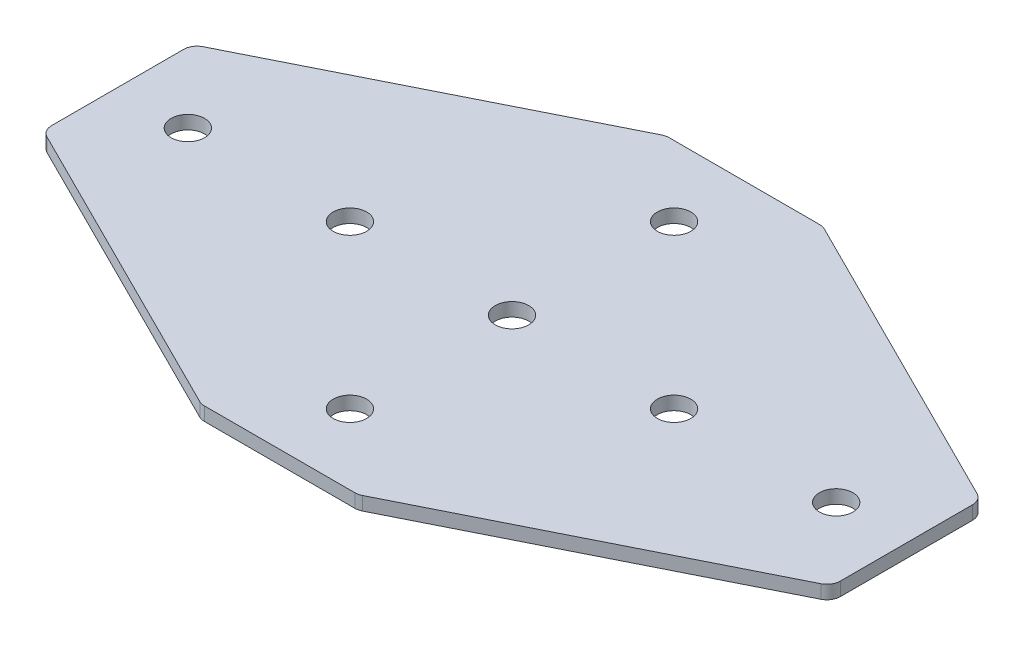
ISO-10303-21;
HEADER;
FILE_DESCRIPTION(('STEP AP214'),'2;1');
FILE_NAME('part.step','',(''),(''),'','','');
FILE_SCHEMA(('AUTOMOTIVE_DESIGN { 1 0 10303 214 1 1 1 1 }'));
ENDSEC;
DATA;
#1=APPLICATION_CONTEXT('core data for automotive mechanical design processes');
#2=APPLICATION_PROTOCOL_DEFINITION('international standard','automotive_design',2000,#1);
#3=PRODUCT_CONTEXT('',#1,'mechanical');
#4=PRODUCT('Part','Part','',(#3));
#5=PRODUCT_RELATED_PRODUCT_CATEGORY('part','',(#4));
#6=PRODUCT_DEFINITION_FORMATION('','',#4);
#7=PRODUCT_DEFINITION_CONTEXT('part definition',#1,'design');
#8=PRODUCT_DEFINITION('design','',#6,#7);
#9=PRODUCT_DEFINITION_SHAPE('','',#8);
#10=(LENGTH_UNIT() NAMED_UNIT(*) SI_UNIT(.MILLI.,.METRE.));
#11=(NAMED_UNIT(*) PLANE_ANGLE_UNIT() SI_UNIT($,.RADIAN.));
#12=(NAMED_UNIT(*) SI_UNIT($,.STERADIAN.) SOLID_ANGLE_UNIT());
#13=UNCERTAINTY_MEASURE_WITH_UNIT(LENGTH_MEASURE(1.E-05),#10,'distance_accuracy_value','');
#14=(GEOMETRIC_REPRESENTATION_CONTEXT(3) GLOBAL_UNCERTAINTY_ASSIGNED_CONTEXT((#13)) GLOBAL_UNIT_ASSIGNED_CONTEXT((#10,
#11,#12)) REPRESENTATION_CONTEXT('',''));
#15=CARTESIAN_POINT('',(0.,0.,0.));
#16=DIRECTION('',(0.,0.,1.));
#17=DIRECTION('',(1.,0.,0.));
#18=AXIS2_PLACEMENT_3D('',#15,#16,#17);
#19=CARTESIAN_POINT('',(-1.7997230439164,1.02470932674123,-0.474616608812539));
#20=DIRECTION('',(0.,-1.,0.));
#21=DIRECTION('',(0.,0.,-1.));
#22=AXIS2_PLACEMENT_3D('',#19,#20,#21);
#23=PLANE('',#22);
#24=CARTESIAN_POINT('',(-31.7997230439164,1.02470932674123,-0.474616608812521));
#25=DIRECTION('',(0.,-1.,0.));
#26=DIRECTION('',(0.,0.,1.));
#27=AXIS2_PLACEMENT_3D('',#24,#25,#26);
#28=CIRCLE('',#27,3.1);
#29=CARTESIAN_POINT('',(-31.7997230439164,1.02470932674123,2.62538339118748));
#30=VERTEX_POINT('',#29);
#31=EDGE_CURVE('E194',#30,#30,#28,.T.);
#32=ORIENTED_EDGE('',*,*,#31,.F.);
#33=EDGE_LOOP('',(#32));
#34=FACE_BOUND('',#33,.T.);
#35=CARTESIAN_POINT('',(-61.7997230439164,1.02470932674123,-0.474616608812524));
#36=DIRECTION('',(0.,-1.,0.));
#37=DIRECTION('',(0.,0.,1.));
#38=AXIS2_PLACEMENT_3D('',#35,#36,#37);
#39=CIRCLE('',#38,3.1);
#40=CARTESIAN_POINT('',(-61.7997230439164,1.02470932674123,2.62538339118748));
#41=VERTEX_POINT('',#40);
#42=EDGE_CURVE('E188',#41,#41,#39,.T.);
#43=ORIENTED_EDGE('',*,*,#42,.F.);
#44=EDGE_LOOP('',(#43));
#45=FACE_BOUND('',#44,.T.);
#46=CARTESIAN_POINT('',(-1.7997230439164,1.02470932674123,-0.474616608812539));
#47=DIRECTION('',(0.,1.,0.));
#48=DIRECTION('',(0.,0.,1.));
#49=AXIS2_PLACEMENT_3D('',#46,#47,#48);
#50=CIRCLE('',#49,3.1);
#51=CARTESIAN_POINT('',(-1.7997230439164,1.02470932674123,2.62538339118746));
#52=VERTEX_POINT('',#51);
#53=EDGE_CURVE('E248',#52,#52,#50,.T.);
#54=ORIENTED_EDGE('',*,*,#53,.T.);
#55=EDGE_LOOP('',(#54));
#56=FACE_BOUND('',#55,.T.);
#57=CARTESIAN_POINT('',(68.7002769560835,1.02470932674123,-12.693463659438));
#58=DIRECTION('',(0.,1.,0.));
#59=DIRECTION('',(0.,0.,1.));
#60=AXIS2_PLACEMENT_3D('',#57,#58,#59);
#61=CIRCLE('',#60,2.5);
#62=CARTESIAN_POINT('',(71.2002769560835,1.02470932674123,-12.693463659438));
#63=VERTEX_POINT('',#62);
#64=CARTESIAN_POINT('',(69.8183109448334,1.02470932674123,-14.9295316369378));
#65=VERTEX_POINT('',#64);
#66=EDGE_CURVE('E174',#63,#65,#61,.T.);
#67=ORIENTED_EDGE('',*,*,#66,.F.);
#68=DIRECTION('',(0.,0.,-1.));
#69=VECTOR('',#68,1.);
#70=CARTESIAN_POINT('',(71.2002769560835,1.02470932674123,13.2893154136877));
#71=LINE('',#70,#69);
#72=CARTESIAN_POINT('',(71.2002769560835,1.02470932674123,11.744230441813));
#73=VERTEX_POINT('',#72);
#74=EDGE_CURVE('E259',#73,#63,#71,.T.);
#75=ORIENTED_EDGE('',*,*,#74,.F.);
#76=CARTESIAN_POINT('',(68.7002769560835,1.02470932674123,11.744230441813));
#77=DIRECTION('',(0.,-1.,0.));
#78=DIRECTION('',(0.,0.,-1.));
#79=AXIS2_PLACEMENT_3D('',#76,#77,#78);
#80=CIRCLE('',#79,2.5);
#81=CARTESIAN_POINT('',(69.8183109448334,1.02470932674123,13.9802984193128));
#82=VERTEX_POINT('',#81);
#83=EDGE_CURVE('E31',#73,#82,#80,.T.);
#84=ORIENTED_EDGE('',*,*,#83,.T.);
#85=DIRECTION('',(0.894427190999916,0.,-0.447213595499958));
#86=VECTOR('',#85,1.);
#87=CARTESIAN_POINT('',(12.7281410010841,1.02470932674123,42.5253833911874));
#88=LINE('',#87,#86);
#89=CARTESIAN_POINT('',(13.2560050460846,1.02470932674123,42.2614513686872));
#90=VERTEX_POINT('',#89);
#91=EDGE_CURVE('E256',#90,#82,#88,.T.);
#92=ORIENTED_EDGE('',*,*,#91,.F.);
#93=CARTESIAN_POINT('',(12.1379710573347,1.02470932674123,40.0253833911874));
#94=DIRECTION('',(0.,-1.,0.));
#95=DIRECTION('',(0.,0.,-1.));
#96=AXIS2_PLACEMENT_3D('',#93,#94,#95);
#97=CIRCLE('',#96,2.5);
#98=CARTESIAN_POINT('',(12.1379710573347,1.02470932674123,42.5253833911874));
#99=VERTEX_POINT('',#98);
#100=EDGE_CURVE('E274',#90,#99,#97,.T.);
#101=ORIENTED_EDGE('',*,*,#100,.T.);
#102=DIRECTION('',(1.,0.,0.));
#103=VECTOR('',#102,1.);
#104=CARTESIAN_POINT('',(-14.7997230439165,1.02470932674123,42.5253833911874));
#105=LINE('',#104,#103);
#106=CARTESIAN_POINT('',(-15.7374171451674,1.02470932674123,42.5253833911874));
#107=VERTEX_POINT('',#106);
#108=EDGE_CURVE('E254',#107,#99,#105,.T.);
#109=ORIENTED_EDGE('',*,*,#108,.F.);
#110=CARTESIAN_POINT('',(-15.7374171451674,1.02470932674123,40.0253833911874));
#111=DIRECTION('',(0.,1.,0.));
#112=DIRECTION('',(0.,0.,-1.));
#113=AXIS2_PLACEMENT_3D('',#110,#111,#112);
#114=CIRCLE('',#113,2.5);
#115=CARTESIAN_POINT('',(-16.8554511339173,1.02470932674123,42.2614513686872));
#116=VERTEX_POINT('',#115);
#117=EDGE_CURVE('E219',#116,#107,#114,.T.);
#118=ORIENTED_EDGE('',*,*,#117,.F.);
#119=DIRECTION('',(-0.894427190999916,0.,-0.447213595499958));
#120=VECTOR('',#119,1.);
#121=CARTESIAN_POINT('',(-16.3275870889169,1.02470932674123,42.5253833911874));
#122=LINE('',#121,#120);
#123=CARTESIAN_POINT('',(-73.4177570326662,1.02470932674123,13.9802984193128));
#124=VERTEX_POINT('',#123);
#125=EDGE_CURVE('E200',#116,#124,#122,.T.);
#126=ORIENTED_EDGE('',*,*,#125,.T.);
#127=CARTESIAN_POINT('',(-72.2997230439163,1.02470932674123,11.744230441813));
#128=DIRECTION('',(0.,1.,0.));
#129=DIRECTION('',(0.,0.,-1.));
#130=AXIS2_PLACEMENT_3D('',#127,#128,#129);
#131=CIRCLE('',#130,2.5);
#132=CARTESIAN_POINT('',(-74.7997230439163,1.02470932674123,11.744230441813));
#133=VERTEX_POINT('',#132);
#134=EDGE_CURVE('E216',#133,#124,#131,.T.);
#135=ORIENTED_EDGE('',*,*,#134,.F.);
#136=DIRECTION('',(0.,0.,-1.));
#137=VECTOR('',#136,1.);
#138=CARTESIAN_POINT('',(-74.7997230439163,1.02470932674123,13.2893154136877));
#139=LINE('',#138,#137);
#140=CARTESIAN_POINT('',(-74.7997230439163,1.02470932674123,-12.6934636594381));
#141=VERTEX_POINT('',#140);
#142=EDGE_CURVE('E203',#133,#141,#139,.T.);
#143=ORIENTED_EDGE('',*,*,#142,.T.);
#144=CARTESIAN_POINT('',(-72.2997230439163,1.02470932674123,-12.6934636594381));
#145=DIRECTION('',(0.,-1.,0.));
#146=DIRECTION('',(0.,0.,1.));
#147=AXIS2_PLACEMENT_3D('',#144,#145,#146);
#148=CIRCLE('',#147,2.5);
#149=CARTESIAN_POINT('',(-73.4177570326662,1.02470932674123,-14.9295316369379));
#150=VERTEX_POINT('',#149);
#151=EDGE_CURVE('E140',#141,#150,#148,.T.);
#152=ORIENTED_EDGE('',*,*,#151,.T.);
#153=DIRECTION('',(-0.894427190999916,0.,0.447213595499958));
#154=VECTOR('',#153,1.);
#155=CARTESIAN_POINT('',(-16.3275870889169,1.02470932674123,-43.4746166088125));
#156=LINE('',#155,#154);
#157=CARTESIAN_POINT('',(-16.8554511339173,1.02470932674123,-43.2106845863123));
#158=VERTEX_POINT('',#157);
#159=EDGE_CURVE('E414',#158,#150,#156,.T.);
#160=ORIENTED_EDGE('',*,*,#159,.F.);
#161=CARTESIAN_POINT('',(-15.7374171451674,1.02470932674123,-40.9746166088125));
#162=DIRECTION('',(0.,-1.,0.));
#163=DIRECTION('',(0.,0.,1.));
#164=AXIS2_PLACEMENT_3D('',#161,#162,#163);
#165=CIRCLE('',#164,2.5);
#166=CARTESIAN_POINT('',(-15.7374171451674,1.02470932674123,-43.4746166088125));
#167=VERTEX_POINT('',#166);
#168=EDGE_CURVE('E399',#158,#167,#165,.T.);
#169=ORIENTED_EDGE('',*,*,#168,.T.);
#170=DIRECTION('',(1.,0.,0.));
#171=VECTOR('',#170,1.);
#172=CARTESIAN_POINT('',(-14.7997230439165,1.02470932674123,-43.4746166088125));
#173=LINE('',#172,#171);
#174=CARTESIAN_POINT('',(12.1379710573347,1.02470932674123,-43.4746166088125));
#175=VERTEX_POINT('',#174);
#176=EDGE_CURVE('E136',#167,#175,#173,.T.);
#177=ORIENTED_EDGE('',*,*,#176,.T.);
#178=CARTESIAN_POINT('',(12.1379710573347,1.02470932674123,-40.9746166088125));
#179=DIRECTION('',(0.,1.,0.));
#180=DIRECTION('',(0.,0.,1.));
#181=AXIS2_PLACEMENT_3D('',#178,#179,#180);
#182=CIRCLE('',#181,2.5);
#183=CARTESIAN_POINT('',(13.2560050460846,1.02470932674123,-43.2106845863123));
#184=VERTEX_POINT('',#183);
#185=EDGE_CURVE('E177',#184,#175,#182,.T.);
#186=ORIENTED_EDGE('',*,*,#185,.F.);
#187=DIRECTION('',(0.894427190999916,0.,0.447213595499958));
#188=VECTOR('',#187,1.);
#189=CARTESIAN_POINT('',(12.7281410010841,1.02470932674123,-43.4746166088125));
#190=LINE('',#189,#188);
#191=EDGE_CURVE('E165',#184,#65,#190,.T.);
#192=ORIENTED_EDGE('',*,*,#191,.T.);
#193=EDGE_LOOP('',(#67,#75,#84,#92,#101,#109,#118,#126,#135,#143,#152,#160,#169,#177,#186,#192));
#194=FACE_BOUND('',#193,.T.);
#195=CARTESIAN_POINT('',(58.2002769560836,1.02470932674123,-0.474616608812539));
#196=DIRECTION('',(0.,1.,0.));
#197=DIRECTION('',(0.,0.,1.));
#198=AXIS2_PLACEMENT_3D('',#195,#196,#197);
#199=CIRCLE('',#198,3.1);
#200=CARTESIAN_POINT('',(58.2002769560836,1.02470932674123,2.62538339118746));
#201=VERTEX_POINT('',#200);
#202=EDGE_CURVE('E230',#201,#201,#199,.T.);
#203=ORIENTED_EDGE('',*,*,#202,.T.);
#204=EDGE_LOOP('',(#203));
#205=FACE_BOUND('',#204,.T.);
#206=CARTESIAN_POINT('',(-1.79972304391641,1.02470932674123,29.5253833911875));
#207=DIRECTION('',(0.,1.,0.));
#208=DIRECTION('',(0.,0.,1.));
#209=AXIS2_PLACEMENT_3D('',#206,#207,#208);
#210=CIRCLE('',#209,3.1);
#211=CARTESIAN_POINT('',(-1.79972304391641,1.02470932674123,32.6253833911875));
#212=VERTEX_POINT('',#211);
#213=EDGE_CURVE('E236',#212,#212,#210,.T.);
#214=ORIENTED_EDGE('',*,*,#213,.T.);
#215=EDGE_LOOP('',(#214));
#216=FACE_BOUND('',#215,.T.);
#217=CARTESIAN_POINT('',(28.2002769560836,1.02470932674123,-0.474616608812529));
#218=DIRECTION('',(0.,1.,0.));
#219=DIRECTION('',(0.,0.,1.));
#220=AXIS2_PLACEMENT_3D('',#217,#218,#219);
#221=CIRCLE('',#220,3.1);
#222=CARTESIAN_POINT('',(28.2002769560836,1.02470932674123,2.62538339118747));
#223=VERTEX_POINT('',#222);
#224=EDGE_CURVE('E242',#223,#223,#221,.T.);
#225=ORIENTED_EDGE('',*,*,#224,.T.);
#226=EDGE_LOOP('',(#225));
#227=FACE_BOUND('',#226,.T.);
#228=CARTESIAN_POINT('',(-1.79972304391641,1.02470932674123,-30.4746166088125));
#229=DIRECTION('',(0.,-1.,0.));
#230=DIRECTION('',(0.,0.,-1.));
#231=AXIS2_PLACEMENT_3D('',#228,#229,#230);
#232=CIRCLE('',#231,3.1);
#233=CARTESIAN_POINT('',(-1.79972304391641,1.02470932674123,-33.5746166088125));
#234=VERTEX_POINT('',#233);
#235=EDGE_CURVE('E157',#234,#234,#232,.T.);
#236=ORIENTED_EDGE('',*,*,#235,.F.);
#237=EDGE_LOOP('',(#236));
#238=FACE_BOUND('',#237,.T.);
#239=ADVANCED_FACE('F16',(#34,#45,#56,#194,#205,#216,#227,#238),#23,.T.);
#240=CARTESIAN_POINT('',(71.2002769560835,1.02470932674123,13.2893154136877));
#241=DIRECTION('',(1.,0.,0.));
#242=DIRECTION('',(0.,0.,-1.));
#243=AXIS2_PLACEMENT_3D('',#240,#241,#242);
#244=PLANE('',#243);
#245=ORIENTED_EDGE('',*,*,#74,.T.);
#246=DIRECTION('',(0.,1.,0.));
#247=VECTOR('',#246,1.);
#248=CARTESIAN_POINT('',(71.2002769560835,1.02470932674123,-12.693463659438));
#249=LINE('',#248,#247);
#250=CARTESIAN_POINT('',(71.2002769560835,3.52470932674123,-12.693463659438));
#251=VERTEX_POINT('',#250);
#252=EDGE_CURVE('E184',#251,#63,#249,.F.);
#253=ORIENTED_EDGE('',*,*,#252,.F.);
#254=DIRECTION('',(0.,0.,-1.));
#255=VECTOR('',#254,1.);
#256=CARTESIAN_POINT('',(71.2002769560835,3.52470932674123,13.2893154136877));
#257=LINE('',#256,#255);
#258=CARTESIAN_POINT('',(71.2002769560835,3.52470932674123,11.744230441813));
#259=VERTEX_POINT('',#258);
#260=EDGE_CURVE('E257',#259,#251,#257,.T.);
#261=ORIENTED_EDGE('',*,*,#260,.F.);
#262=DIRECTION('',(0.,1.,0.));
#263=VECTOR('',#262,1.);
#264=CARTESIAN_POINT('',(71.2002769560835,1.02470932674123,11.744230441813));
#265=LINE('',#264,#263);
#266=EDGE_CURVE('E10',#259,#73,#265,.F.);
#267=ORIENTED_EDGE('',*,*,#266,.T.);
#268=EDGE_LOOP('',(#245,#253,#261,#267));
#269=FACE_BOUND('',#268,.T.);
#270=ADVANCED_FACE('F297',(#269),#244,.T.);
#271=CARTESIAN_POINT('',(-1.7997230439164,3.52470932674123,-0.474616608812539));
#272=DIRECTION('',(0.,-1.,0.));
#273=DIRECTION('',(0.,0.,-1.));
#274=AXIS2_PLACEMENT_3D('',#271,#272,#273);
#275=PLANE('',#274);
#276=CARTESIAN_POINT('',(-31.7997230439164,3.52470932674123,-0.474616608812521));
#277=DIRECTION('',(0.,-1.,0.));
#278=DIRECTION('',(0.,0.,1.));
#279=AXIS2_PLACEMENT_3D('',#276,#277,#278);
#280=CIRCLE('',#279,3.1);
#281=CARTESIAN_POINT('',(-31.7997230439164,3.52470932674123,2.62538339118748));
#282=VERTEX_POINT('',#281);
#283=EDGE_CURVE('E191',#282,#282,#280,.T.);
#284=ORIENTED_EDGE('',*,*,#283,.T.);
#285=EDGE_LOOP('',(#284));
#286=FACE_BOUND('',#285,.T.);
#287=CARTESIAN_POINT('',(-61.7997230439164,3.52470932674123,-0.474616608812524));
#288=DIRECTION('',(0.,-1.,0.));
#289=DIRECTION('',(0.,0.,1.));
#290=AXIS2_PLACEMENT_3D('',#287,#288,#289);
#291=CIRCLE('',#290,3.1);
#292=CARTESIAN_POINT('',(-61.7997230439164,3.52470932674123,2.62538339118748));
#293=VERTEX_POINT('',#292);
#294=EDGE_CURVE('E187',#293,#293,#291,.T.);
#295=ORIENTED_EDGE('',*,*,#294,.T.);
#296=EDGE_LOOP('',(#295));
#297=FACE_BOUND('',#296,.T.);
#298=CARTESIAN_POINT('',(-1.7997230439164,3.52470932674123,-0.474616608812539));
#299=DIRECTION('',(0.,1.,0.));
#300=DIRECTION('',(0.,0.,1.));
#301=AXIS2_PLACEMENT_3D('',#298,#299,#300);
#302=CIRCLE('',#301,3.1);
#303=CARTESIAN_POINT('',(-1.7997230439164,3.52470932674123,2.62538339118746));
#304=VERTEX_POINT('',#303);
#305=EDGE_CURVE('E245',#304,#304,#302,.T.);
#306=ORIENTED_EDGE('',*,*,#305,.F.);
#307=EDGE_LOOP('',(#306));
#308=FACE_BOUND('',#307,.T.);
#309=ORIENTED_EDGE('',*,*,#260,.T.);
#310=CARTESIAN_POINT('',(68.7002769560835,3.52470932674123,-12.693463659438));
#311=DIRECTION('',(0.,1.,0.));
#312=DIRECTION('',(0.,0.,1.));
#313=AXIS2_PLACEMENT_3D('',#310,#311,#312);
#314=CIRCLE('',#313,2.5);
#315=CARTESIAN_POINT('',(69.8183109448334,3.52470932674123,-14.9295316369378));
#316=VERTEX_POINT('',#315);
#317=EDGE_CURVE('E168',#316,#251,#314,.F.);
#318=ORIENTED_EDGE('',*,*,#317,.F.);
#319=DIRECTION('',(0.894427190999916,0.,0.447213595499958));
#320=VECTOR('',#319,1.);
#321=CARTESIAN_POINT('',(12.7281410010841,3.52470932674123,-43.4746166088125));
#322=LINE('',#321,#320);
#323=CARTESIAN_POINT('',(13.2560050460846,3.52470932674123,-43.2106845863123));
#324=VERTEX_POINT('',#323);
#325=EDGE_CURVE('E156',#324,#316,#322,.T.);
#326=ORIENTED_EDGE('',*,*,#325,.F.);
#327=CARTESIAN_POINT('',(12.1379710573347,3.52470932674123,-40.9746166088125));
#328=DIRECTION('',(0.,1.,0.));
#329=DIRECTION('',(0.,0.,1.));
#330=AXIS2_PLACEMENT_3D('',#327,#328,#329);
#331=CIRCLE('',#330,2.5);
#332=CARTESIAN_POINT('',(12.1379710573347,3.52470932674123,-43.4746166088125));
#333=VERTEX_POINT('',#332);
#334=EDGE_CURVE('E155',#333,#324,#331,.F.);
#335=ORIENTED_EDGE('',*,*,#334,.F.);
#336=DIRECTION('',(1.,0.,0.));
#337=VECTOR('',#336,1.);
#338=CARTESIAN_POINT('',(-14.7997230439165,3.52470932674123,-43.4746166088125));
#339=LINE('',#338,#337);
#340=CARTESIAN_POINT('',(-15.7374171451674,3.52470932674123,-43.4746166088125));
#341=VERTEX_POINT('',#340);
#342=EDGE_CURVE('E133',#341,#333,#339,.T.);
#343=ORIENTED_EDGE('',*,*,#342,.F.);
#344=CARTESIAN_POINT('',(-15.7374171451674,3.52470932674123,-40.9746166088125));
#345=DIRECTION('',(0.,-1.,0.));
#346=DIRECTION('',(0.,0.,1.));
#347=AXIS2_PLACEMENT_3D('',#344,#345,#346);
#348=CIRCLE('',#347,2.5);
#349=CARTESIAN_POINT('',(-16.8554511339173,3.52470932674123,-43.2106845863123));
#350=VERTEX_POINT('',#349);
#351=EDGE_CURVE('E141',#341,#350,#348,.F.);
#352=ORIENTED_EDGE('',*,*,#351,.T.);
#353=DIRECTION('',(-0.894427190999916,0.,0.447213595499958));
#354=VECTOR('',#353,1.);
#355=CARTESIAN_POINT('',(-16.3275870889169,3.52470932674123,-43.4746166088125));
#356=LINE('',#355,#354);
#357=CARTESIAN_POINT('',(-73.4177570326662,3.52470932674123,-14.9295316369379));
#358=VERTEX_POINT('',#357);
#359=EDGE_CURVE('E415',#350,#358,#356,.T.);
#360=ORIENTED_EDGE('',*,*,#359,.T.);
#361=CARTESIAN_POINT('',(-72.2997230439163,3.52470932674123,-12.6934636594381));
#362=DIRECTION('',(0.,-1.,0.));
#363=DIRECTION('',(0.,0.,1.));
#364=AXIS2_PLACEMENT_3D('',#361,#362,#363);
#365=CIRCLE('',#364,2.5);
#366=CARTESIAN_POINT('',(-74.7997230439163,3.52470932674123,-12.6934636594381));
#367=VERTEX_POINT('',#366);
#368=EDGE_CURVE('E149',#358,#367,#365,.F.);
#369=ORIENTED_EDGE('',*,*,#368,.T.);
#370=DIRECTION('',(0.,0.,-1.));
#371=VECTOR('',#370,1.);
#372=CARTESIAN_POINT('',(-74.7997230439163,3.52470932674123,13.2893154136877));
#373=LINE('',#372,#371);
#374=CARTESIAN_POINT('',(-74.7997230439163,3.52470932674123,11.744230441813));
#375=VERTEX_POINT('',#374);
#376=EDGE_CURVE('E204',#375,#367,#373,.T.);
#377=ORIENTED_EDGE('',*,*,#376,.F.);
#378=CARTESIAN_POINT('',(-72.2997230439163,3.52470932674123,11.744230441813));
#379=DIRECTION('',(0.,1.,0.));
#380=DIRECTION('',(0.,0.,-1.));
#381=AXIS2_PLACEMENT_3D('',#378,#379,#380);
#382=CIRCLE('',#381,2.5);
#383=CARTESIAN_POINT('',(-73.4177570326662,3.52470932674123,13.9802984193128));
#384=VERTEX_POINT('',#383);
#385=EDGE_CURVE('E206',#384,#375,#382,.F.);
#386=ORIENTED_EDGE('',*,*,#385,.F.);
#387=DIRECTION('',(-0.894427190999916,0.,-0.447213595499958));
#388=VECTOR('',#387,1.);
#389=CARTESIAN_POINT('',(-16.3275870889169,3.52470932674123,42.5253833911874));
#390=LINE('',#389,#388);
#391=CARTESIAN_POINT('',(-16.8554511339173,3.52470932674123,42.2614513686872));
#392=VERTEX_POINT('',#391);
#393=EDGE_CURVE('E197',#392,#384,#390,.T.);
#394=ORIENTED_EDGE('',*,*,#393,.F.);
#395=CARTESIAN_POINT('',(-15.7374171451674,3.52470932674123,40.0253833911874));
#396=DIRECTION('',(0.,1.,0.));
#397=DIRECTION('',(0.,0.,-1.));
#398=AXIS2_PLACEMENT_3D('',#395,#396,#397);
#399=CIRCLE('',#398,2.5);
#400=CARTESIAN_POINT('',(-15.7374171451674,3.52470932674123,42.5253833911874));
#401=VERTEX_POINT('',#400);
#402=EDGE_CURVE('E211',#401,#392,#399,.F.);
#403=ORIENTED_EDGE('',*,*,#402,.F.);
#404=DIRECTION('',(1.,0.,0.));
#405=VECTOR('',#404,1.);
#406=CARTESIAN_POINT('',(-14.7997230439165,3.52470932674123,42.5253833911874));
#407=LINE('',#406,#405);
#408=CARTESIAN_POINT('',(12.1379710573347,3.52470932674123,42.5253833911874));
#409=VERTEX_POINT('',#408);
#410=EDGE_CURVE('E251',#401,#409,#407,.T.);
#411=ORIENTED_EDGE('',*,*,#410,.T.);
#412=CARTESIAN_POINT('',(12.1379710573347,3.52470932674123,40.0253833911874));
#413=DIRECTION('',(0.,-1.,0.));
#414=DIRECTION('',(0.,0.,-1.));
#415=AXIS2_PLACEMENT_3D('',#412,#413,#414);
#416=CIRCLE('',#415,2.5);
#417=CARTESIAN_POINT('',(13.2560050460846,3.52470932674123,42.2614513686872));
#418=VERTEX_POINT('',#417);
#419=EDGE_CURVE('E268',#409,#418,#416,.F.);
#420=ORIENTED_EDGE('',*,*,#419,.T.);
#421=DIRECTION('',(0.894427190999916,0.,-0.447213595499958));
#422=VECTOR('',#421,1.);
#423=CARTESIAN_POINT('',(12.7281410010841,3.52470932674123,42.5253833911874));
#424=LINE('',#423,#422);
#425=CARTESIAN_POINT('',(69.8183109448334,3.52470932674123,13.9802984193128));
#426=VERTEX_POINT('',#425);
#427=EDGE_CURVE('E263',#418,#426,#424,.T.);
#428=ORIENTED_EDGE('',*,*,#427,.T.);
#429=CARTESIAN_POINT('',(68.7002769560835,3.52470932674123,11.744230441813));
#430=DIRECTION('',(0.,-1.,0.));
#431=DIRECTION('',(0.,0.,-1.));
#432=AXIS2_PLACEMENT_3D('',#429,#430,#431);
#433=CIRCLE('',#432,2.5);
#434=EDGE_CURVE('E261',#426,#259,#433,.F.);
#435=ORIENTED_EDGE('',*,*,#434,.T.);
#436=EDGE_LOOP('',(#309,#318,#326,#335,#343,#352,#360,#369,#377,#386,#394,#403,#411,#420,#428,#435));
#437=FACE_BOUND('',#436,.T.);
#438=CARTESIAN_POINT('',(58.2002769560836,3.52470932674123,-0.474616608812539));
#439=DIRECTION('',(0.,1.,0.));
#440=DIRECTION('',(0.,0.,1.));
#441=AXIS2_PLACEMENT_3D('',#438,#439,#440);
#442=CIRCLE('',#441,3.1);
#443=CARTESIAN_POINT('',(58.2002769560836,3.52470932674123,2.62538339118746));
#444=VERTEX_POINT('',#443);
#445=EDGE_CURVE('E229',#444,#444,#442,.T.);
#446=ORIENTED_EDGE('',*,*,#445,.F.);
#447=EDGE_LOOP('',(#446));
#448=FACE_BOUND('',#447,.T.);
#449=CARTESIAN_POINT('',(-1.79972304391641,3.52470932674123,29.5253833911875));
#450=DIRECTION('',(0.,1.,0.));
#451=DIRECTION('',(0.,0.,1.));
#452=AXIS2_PLACEMENT_3D('',#449,#450,#451);
#453=CIRCLE('',#452,3.1);
#454=CARTESIAN_POINT('',(-1.79972304391641,3.52470932674123,32.6253833911875));
#455=VERTEX_POINT('',#454);
#456=EDGE_CURVE('E233',#455,#455,#453,.T.);
#457=ORIENTED_EDGE('',*,*,#456,.F.);
#458=EDGE_LOOP('',(#457));
#459=FACE_BOUND('',#458,.T.);
#460=CARTESIAN_POINT('',(28.2002769560836,3.52470932674123,-0.474616608812529));
#461=DIRECTION('',(0.,1.,0.));
#462=DIRECTION('',(0.,0.,1.));
#463=AXIS2_PLACEMENT_3D('',#460,#461,#462);
#464=CIRCLE('',#463,3.1);
#465=CARTESIAN_POINT('',(28.2002769560836,3.52470932674123,2.62538339118747));
#466=VERTEX_POINT('',#465);
#467=EDGE_CURVE('E239',#466,#466,#464,.T.);
#468=ORIENTED_EDGE('',*,*,#467,.F.);
#469=EDGE_LOOP('',(#468));
#470=FACE_BOUND('',#469,.T.);
#471=CARTESIAN_POINT('',(-1.79972304391641,3.52470932674123,-30.4746166088125));
#472=DIRECTION('',(0.,-1.,0.));
#473=DIRECTION('',(0.,0.,-1.));
#474=AXIS2_PLACEMENT_3D('',#471,#472,#473);
#475=CIRCLE('',#474,3.1);
#476=CARTESIAN_POINT('',(-1.79972304391641,3.52470932674123,-33.5746166088125));
#477=VERTEX_POINT('',#476);
#478=EDGE_CURVE('E162',#477,#477,#475,.T.);
#479=ORIENTED_EDGE('',*,*,#478,.T.);
#480=EDGE_LOOP('',(#479));
#481=FACE_BOUND('',#480,.T.);
#482=ADVANCED_FACE('F151',(#286,#297,#308,#437,#448,#459,#470,#481),#275,.F.);
#483=CARTESIAN_POINT('',(-1.7997230439164,1.02470932674123,-0.474616608812539));
#484=DIRECTION('',(0.,1.,0.));
#485=DIRECTION('',(0.,0.,1.));
#486=AXIS2_PLACEMENT_3D('',#483,#484,#485);
#487=CYLINDRICAL_SURFACE('',#486,3.1);
#488=ORIENTED_EDGE('',*,*,#53,.F.);
#489=EDGE_LOOP('',(#488));
#490=FACE_BOUND('',#489,.T.);
#491=ORIENTED_EDGE('',*,*,#305,.T.);
#492=EDGE_LOOP('',(#491));
#493=FACE_BOUND('',#492,.T.);
#494=ADVANCED_FACE('F373',(#490,#493),#487,.F.);
#495=CARTESIAN_POINT('',(28.2002769560836,1.02470932674123,-0.474616608812529));
#496=DIRECTION('',(0.,1.,0.));
#497=DIRECTION('',(0.,0.,1.));
#498=AXIS2_PLACEMENT_3D('',#495,#496,#497);
#499=CYLINDRICAL_SURFACE('',#498,3.1);
#500=ORIENTED_EDGE('',*,*,#467,.T.);
#501=EDGE_LOOP('',(#500));
#502=FACE_BOUND('',#501,.T.);
#503=ORIENTED_EDGE('',*,*,#224,.F.);
#504=EDGE_LOOP('',(#503));
#505=FACE_BOUND('',#504,.T.);
#506=ADVANCED_FACE('F366',(#502,#505),#499,.F.);
#507=CARTESIAN_POINT('',(58.2002769560836,1.02470932674123,-0.474616608812539));
#508=DIRECTION('',(0.,1.,0.));
#509=DIRECTION('',(0.,0.,1.));
#510=AXIS2_PLACEMENT_3D('',#507,#508,#509);
#511=CYLINDRICAL_SURFACE('',#510,3.1);
#512=ORIENTED_EDGE('',*,*,#445,.T.);
#513=EDGE_LOOP('',(#512));
#514=FACE_BOUND('',#513,.T.);
#515=ORIENTED_EDGE('',*,*,#202,.F.);
#516=EDGE_LOOP('',(#515));
#517=FACE_BOUND('',#516,.T.);
#518=ADVANCED_FACE('F350',(#514,#517),#511,.F.);
#519=CARTESIAN_POINT('',(-74.7997230439163,1.02470932674123,13.2893154136877));
#520=DIRECTION('',(-1.,0.,0.));
#521=DIRECTION('',(0.,0.,-1.));
#522=AXIS2_PLACEMENT_3D('',#519,#520,#521);
#523=PLANE('',#522);
#524=ORIENTED_EDGE('',*,*,#376,.T.);
#525=DIRECTION('',(0.,1.,0.));
#526=VECTOR('',#525,1.);
#527=CARTESIAN_POINT('',(-74.7997230439163,1.02470932674123,-12.6934636594381));
#528=LINE('',#527,#526);
#529=EDGE_CURVE('E402',#367,#141,#528,.F.);
#530=ORIENTED_EDGE('',*,*,#529,.T.);
#531=ORIENTED_EDGE('',*,*,#142,.F.);
#532=DIRECTION('',(0.,1.,0.));
#533=VECTOR('',#532,1.);
#534=CARTESIAN_POINT('',(-74.7997230439163,1.02470932674123,11.744230441813));
#535=LINE('',#534,#533);
#536=EDGE_CURVE('E227',#375,#133,#535,.F.);
#537=ORIENTED_EDGE('',*,*,#536,.F.);
#538=EDGE_LOOP('',(#524,#530,#531,#537));
#539=FACE_BOUND('',#538,.T.);
#540=ADVANCED_FACE('F346',(#539),#523,.T.);
#541=CARTESIAN_POINT('',(-31.7997230439164,1.02470932674123,-0.474616608812521));
#542=DIRECTION('',(0.,1.,0.));
#543=DIRECTION('',(0.,0.,1.));
#544=AXIS2_PLACEMENT_3D('',#541,#542,#543);
#545=CYLINDRICAL_SURFACE('',#544,3.1);
#546=ORIENTED_EDGE('',*,*,#31,.T.);
#547=EDGE_LOOP('',(#546));
#548=FACE_BOUND('',#547,.T.);
#549=ORIENTED_EDGE('',*,*,#283,.F.);
#550=EDGE_LOOP('',(#549));
#551=FACE_BOUND('',#550,.T.);
#552=ADVANCED_FACE('F342',(#548,#551),#545,.F.);
#553=CARTESIAN_POINT('',(-61.7997230439164,1.02470932674123,-0.474616608812524));
#554=DIRECTION('',(0.,1.,0.));
#555=DIRECTION('',(0.,0.,1.));
#556=AXIS2_PLACEMENT_3D('',#553,#554,#555);
#557=CYLINDRICAL_SURFACE('',#556,3.1);
#558=ORIENTED_EDGE('',*,*,#294,.F.);
#559=EDGE_LOOP('',(#558));
#560=FACE_BOUND('',#559,.T.);
#561=ORIENTED_EDGE('',*,*,#42,.T.);
#562=EDGE_LOOP('',(#561));
#563=FACE_BOUND('',#562,.T.);
#564=ADVANCED_FACE('F339',(#560,#563),#557,.F.);
#565=CARTESIAN_POINT('',(12.7281410010841,1.02470932674123,42.5253833911874));
#566=DIRECTION('',(0.447213595499958,0.,0.894427190999916));
#567=DIRECTION('',(0.894427190999916,0.,-0.447213595499958));
#568=AXIS2_PLACEMENT_3D('',#565,#566,#567);
#569=PLANE('',#568);
#570=ORIENTED_EDGE('',*,*,#427,.F.);
#571=DIRECTION('',(0.,1.,0.));
#572=VECTOR('',#571,1.);
#573=CARTESIAN_POINT('',(13.2560050460846,1.02470932674123,42.2614513686872));
#574=LINE('',#573,#572);
#575=EDGE_CURVE('E24',#418,#90,#574,.F.);
#576=ORIENTED_EDGE('',*,*,#575,.T.);
#577=ORIENTED_EDGE('',*,*,#91,.T.);
#578=DIRECTION('',(0.,1.,0.));
#579=VECTOR('',#578,1.);
#580=CARTESIAN_POINT('',(69.8183109448334,1.02470932674123,13.9802984193128));
#581=LINE('',#580,#579);
#582=EDGE_CURVE('E277',#82,#426,#581,.T.);
#583=ORIENTED_EDGE('',*,*,#582,.T.);
#584=EDGE_LOOP('',(#570,#576,#577,#583));
#585=FACE_BOUND('',#584,.T.);
#586=ADVANCED_FACE('F280',(#585),#569,.T.);
#587=CARTESIAN_POINT('',(-14.7997230439165,1.02470932674123,42.5253833911874));
#588=DIRECTION('',(0.,0.,1.));
#589=DIRECTION('',(1.,0.,0.));
#590=AXIS2_PLACEMENT_3D('',#587,#588,#589);
#591=PLANE('',#590);
#592=ORIENTED_EDGE('',*,*,#410,.F.);
#593=DIRECTION('',(0.,1.,0.));
#594=VECTOR('',#593,1.);
#595=CARTESIAN_POINT('',(-15.7374171451674,1.02470932674123,42.5253833911874));
#596=LINE('',#595,#594);
#597=EDGE_CURVE('E213',#107,#401,#596,.T.);
#598=ORIENTED_EDGE('',*,*,#597,.F.);
#599=ORIENTED_EDGE('',*,*,#108,.T.);
#600=DIRECTION('',(0.,1.,0.));
#601=VECTOR('',#600,1.);
#602=CARTESIAN_POINT('',(12.1379710573347,1.02470932674123,42.5253833911874));
#603=LINE('',#602,#601);
#604=EDGE_CURVE('E270',#99,#409,#603,.T.);
#605=ORIENTED_EDGE('',*,*,#604,.T.);
#606=EDGE_LOOP('',(#592,#598,#599,#605));
#607=FACE_BOUND('',#606,.T.);
#608=ADVANCED_FACE('F290',(#607),#591,.T.);
#609=CARTESIAN_POINT('',(12.1379710573347,1.02470932674123,40.0253833911874));
#610=DIRECTION('',(0.,1.,0.));
#611=DIRECTION('',(0.,0.,1.));
#612=AXIS2_PLACEMENT_3D('',#609,#610,#611);
#613=CYLINDRICAL_SURFACE('',#612,2.5);
#614=ORIENTED_EDGE('',*,*,#100,.F.);
#615=ORIENTED_EDGE('',*,*,#575,.F.);
#616=ORIENTED_EDGE('',*,*,#419,.F.);
#617=ORIENTED_EDGE('',*,*,#604,.F.);
#618=EDGE_LOOP('',(#614,#615,#616,#617));
#619=FACE_BOUND('',#618,.T.);
#620=ADVANCED_FACE('F288',(#619),#613,.T.);
#621=CARTESIAN_POINT('',(68.7002769560835,1.02470932674123,11.744230441813));
#622=DIRECTION('',(0.,1.,0.));
#623=DIRECTION('',(0.,0.,1.));
#624=AXIS2_PLACEMENT_3D('',#621,#622,#623);
#625=CYLINDRICAL_SURFACE('',#624,2.5);
#626=ORIENTED_EDGE('',*,*,#83,.F.);
#627=ORIENTED_EDGE('',*,*,#266,.F.);
#628=ORIENTED_EDGE('',*,*,#434,.F.);
#629=ORIENTED_EDGE('',*,*,#582,.F.);
#630=EDGE_LOOP('',(#626,#627,#628,#629));
#631=FACE_BOUND('',#630,.T.);
#632=ADVANCED_FACE('F18',(#631),#625,.T.);
#633=CARTESIAN_POINT('',(-1.79972304391641,1.02470932674123,29.5253833911875));
#634=DIRECTION('',(0.,1.,0.));
#635=DIRECTION('',(0.,0.,1.));
#636=AXIS2_PLACEMENT_3D('',#633,#634,#635);
#637=CYLINDRICAL_SURFACE('',#636,3.1);
#638=ORIENTED_EDGE('',*,*,#456,.T.);
#639=EDGE_LOOP('',(#638));
#640=FACE_BOUND('',#639,.T.);
#641=ORIENTED_EDGE('',*,*,#213,.F.);
#642=EDGE_LOOP('',(#641));
#643=FACE_BOUND('',#642,.T.);
#644=ADVANCED_FACE('F356',(#640,#643),#637,.F.);
#645=CARTESIAN_POINT('',(-16.3275870889169,1.02470932674123,42.5253833911874));
#646=DIRECTION('',(-0.447213595499958,0.,0.894427190999916));
#647=DIRECTION('',(-0.894427190999916,0.,-0.447213595499958));
#648=AXIS2_PLACEMENT_3D('',#645,#646,#647);
#649=PLANE('',#648);
#650=ORIENTED_EDGE('',*,*,#393,.T.);
#651=DIRECTION('',(0.,1.,0.));
#652=VECTOR('',#651,1.);
#653=CARTESIAN_POINT('',(-73.4177570326662,1.02470932674123,13.9802984193128));
#654=LINE('',#653,#652);
#655=EDGE_CURVE('E222',#124,#384,#654,.T.);
#656=ORIENTED_EDGE('',*,*,#655,.F.);
#657=ORIENTED_EDGE('',*,*,#125,.F.);
#658=DIRECTION('',(0.,1.,0.));
#659=VECTOR('',#658,1.);
#660=CARTESIAN_POINT('',(-16.8554511339173,1.02470932674123,42.2614513686872));
#661=LINE('',#660,#659);
#662=EDGE_CURVE('E225',#392,#116,#661,.F.);
#663=ORIENTED_EDGE('',*,*,#662,.F.);
#664=EDGE_LOOP('',(#650,#656,#657,#663));
#665=FACE_BOUND('',#664,.T.);
#666=ADVANCED_FACE('F352',(#665),#649,.T.);
#667=CARTESIAN_POINT('',(-15.7374171451674,1.02470932674123,40.0253833911874));
#668=DIRECTION('',(0.,1.,0.));
#669=DIRECTION('',(0.,0.,1.));
#670=AXIS2_PLACEMENT_3D('',#667,#668,#669);
#671=CYLINDRICAL_SURFACE('',#670,2.5);
#672=ORIENTED_EDGE('',*,*,#117,.T.);
#673=ORIENTED_EDGE('',*,*,#597,.T.);
#674=ORIENTED_EDGE('',*,*,#402,.T.);
#675=ORIENTED_EDGE('',*,*,#662,.T.);
#676=EDGE_LOOP('',(#672,#673,#674,#675));
#677=FACE_BOUND('',#676,.T.);
#678=ADVANCED_FACE('F355',(#677),#671,.T.);
#679=CARTESIAN_POINT('',(-72.2997230439163,1.02470932674123,11.744230441813));
#680=DIRECTION('',(0.,1.,0.));
#681=DIRECTION('',(0.,0.,1.));
#682=AXIS2_PLACEMENT_3D('',#679,#680,#681);
#683=CYLINDRICAL_SURFACE('',#682,2.5);
#684=ORIENTED_EDGE('',*,*,#134,.T.);
#685=ORIENTED_EDGE('',*,*,#655,.T.);
#686=ORIENTED_EDGE('',*,*,#385,.T.);
#687=ORIENTED_EDGE('',*,*,#536,.T.);
#688=EDGE_LOOP('',(#684,#685,#686,#687));
#689=FACE_BOUND('',#688,.T.);
#690=ADVANCED_FACE('F332',(#689),#683,.T.);
#691=CARTESIAN_POINT('',(12.7281410010841,1.02470932674123,-43.4746166088125));
#692=DIRECTION('',(0.447213595499958,0.,-0.894427190999916));
#693=DIRECTION('',(0.894427190999916,0.,0.447213595499958));
#694=AXIS2_PLACEMENT_3D('',#691,#692,#693);
#695=PLANE('',#694);
#696=ORIENTED_EDGE('',*,*,#325,.T.);
#697=DIRECTION('',(0.,1.,0.));
#698=VECTOR('',#697,1.);
#699=CARTESIAN_POINT('',(69.8183109448334,1.02470932674123,-14.9295316369378));
#700=LINE('',#699,#698);
#701=EDGE_CURVE('E180',#65,#316,#700,.T.);
#702=ORIENTED_EDGE('',*,*,#701,.F.);
#703=ORIENTED_EDGE('',*,*,#191,.F.);
#704=DIRECTION('',(0.,1.,0.));
#705=VECTOR('',#704,1.);
#706=CARTESIAN_POINT('',(13.2560050460846,1.02470932674123,-43.2106845863123));
#707=LINE('',#706,#705);
#708=EDGE_CURVE('E182',#324,#184,#707,.F.);
#709=ORIENTED_EDGE('',*,*,#708,.F.);
#710=EDGE_LOOP('',(#696,#702,#703,#709));
#711=FACE_BOUND('',#710,.T.);
#712=ADVANCED_FACE('F329',(#711),#695,.T.);
#713=CARTESIAN_POINT('',(-14.7997230439165,1.02470932674123,-43.4746166088125));
#714=DIRECTION('',(0.,0.,-1.));
#715=DIRECTION('',(1.,0.,0.));
#716=AXIS2_PLACEMENT_3D('',#713,#714,#715);
#717=PLANE('',#716);
#718=ORIENTED_EDGE('',*,*,#342,.T.);
#719=DIRECTION('',(0.,1.,0.));
#720=VECTOR('',#719,1.);
#721=CARTESIAN_POINT('',(12.1379710573347,1.02470932674123,-43.4746166088125));
#722=LINE('',#721,#720);
#723=EDGE_CURVE('E172',#175,#333,#722,.T.);
#724=ORIENTED_EDGE('',*,*,#723,.F.);
#725=ORIENTED_EDGE('',*,*,#176,.F.);
#726=DIRECTION('',(0.,1.,0.));
#727=VECTOR('',#726,1.);
#728=CARTESIAN_POINT('',(-15.7374171451674,1.02470932674123,-43.4746166088125));
#729=LINE('',#728,#727);
#730=EDGE_CURVE('E129',#167,#341,#729,.T.);
#731=ORIENTED_EDGE('',*,*,#730,.T.);
#732=EDGE_LOOP('',(#718,#724,#725,#731));
#733=FACE_BOUND('',#732,.T.);
#734=ADVANCED_FACE('F131',(#733),#717,.T.);
#735=CARTESIAN_POINT('',(12.1379710573347,1.02470932674123,-40.9746166088125));
#736=DIRECTION('',(0.,1.,0.));
#737=DIRECTION('',(0.,0.,-1.));
#738=AXIS2_PLACEMENT_3D('',#735,#736,#737);
#739=CYLINDRICAL_SURFACE('',#738,2.5);
#740=ORIENTED_EDGE('',*,*,#185,.T.);
#741=ORIENTED_EDGE('',*,*,#723,.T.);
#742=ORIENTED_EDGE('',*,*,#334,.T.);
#743=ORIENTED_EDGE('',*,*,#708,.T.);
#744=EDGE_LOOP('',(#740,#741,#742,#743));
#745=FACE_BOUND('',#744,.T.);
#746=ADVANCED_FACE('F321',(#745),#739,.T.);
#747=CARTESIAN_POINT('',(68.7002769560835,1.02470932674123,-12.693463659438));
#748=DIRECTION('',(0.,1.,0.));
#749=DIRECTION('',(0.,0.,-1.));
#750=AXIS2_PLACEMENT_3D('',#747,#748,#749);
#751=CYLINDRICAL_SURFACE('',#750,2.5);
#752=ORIENTED_EDGE('',*,*,#66,.T.);
#753=ORIENTED_EDGE('',*,*,#701,.T.);
#754=ORIENTED_EDGE('',*,*,#317,.T.);
#755=ORIENTED_EDGE('',*,*,#252,.T.);
#756=EDGE_LOOP('',(#752,#753,#754,#755));
#757=FACE_BOUND('',#756,.T.);
#758=ADVANCED_FACE('F311',(#757),#751,.T.);
#759=CARTESIAN_POINT('',(-1.79972304391641,1.02470932674123,-30.4746166088125));
#760=DIRECTION('',(0.,1.,0.));
#761=DIRECTION('',(0.,0.,-1.));
#762=AXIS2_PLACEMENT_3D('',#759,#760,#761);
#763=CYLINDRICAL_SURFACE('',#762,3.1);
#764=ORIENTED_EDGE('',*,*,#478,.F.);
#765=EDGE_LOOP('',(#764));
#766=FACE_BOUND('',#765,.T.);
#767=ORIENTED_EDGE('',*,*,#235,.T.);
#768=EDGE_LOOP('',(#767));
#769=FACE_BOUND('',#768,.T.);
#770=ADVANCED_FACE('F308',(#766,#769),#763,.F.);
#771=CARTESIAN_POINT('',(-16.3275870889169,1.02470932674123,-43.4746166088125));
#772=DIRECTION('',(-0.447213595499958,0.,-0.894427190999916));
#773=DIRECTION('',(-0.894427190999916,0.,0.447213595499958));
#774=AXIS2_PLACEMENT_3D('',#771,#772,#773);
#775=PLANE('',#774);
#776=ORIENTED_EDGE('',*,*,#359,.F.);
#777=DIRECTION('',(0.,1.,0.));
#778=VECTOR('',#777,1.);
#779=CARTESIAN_POINT('',(-16.8554511339173,1.02470932674123,-43.2106845863123));
#780=LINE('',#779,#778);
#781=EDGE_CURVE('E145',#350,#158,#780,.F.);
#782=ORIENTED_EDGE('',*,*,#781,.T.);
#783=ORIENTED_EDGE('',*,*,#159,.T.);
#784=DIRECTION('',(0.,1.,0.));
#785=VECTOR('',#784,1.);
#786=CARTESIAN_POINT('',(-73.4177570326662,1.02470932674123,-14.9295316369379));
#787=LINE('',#786,#785);
#788=EDGE_CURVE('E407',#150,#358,#787,.T.);
#789=ORIENTED_EDGE('',*,*,#788,.T.);
#790=EDGE_LOOP('',(#776,#782,#783,#789));
#791=FACE_BOUND('',#790,.T.);
#792=ADVANCED_FACE('F310',(#791),#775,.T.);
#793=CARTESIAN_POINT('',(-15.7374171451674,1.02470932674123,-40.9746166088125));
#794=DIRECTION('',(0.,1.,0.));
#795=DIRECTION('',(0.,0.,-1.));
#796=AXIS2_PLACEMENT_3D('',#793,#794,#795);
#797=CYLINDRICAL_SURFACE('',#796,2.5);
#798=ORIENTED_EDGE('',*,*,#168,.F.);
#799=ORIENTED_EDGE('',*,*,#781,.F.);
#800=ORIENTED_EDGE('',*,*,#351,.F.);
#801=ORIENTED_EDGE('',*,*,#730,.F.);
#802=EDGE_LOOP('',(#798,#799,#800,#801));
#803=FACE_BOUND('',#802,.T.);
#804=ADVANCED_FACE('F144',(#803),#797,.T.);
#805=CARTESIAN_POINT('',(-72.2997230439163,1.02470932674123,-12.6934636594381));
#806=DIRECTION('',(0.,1.,0.));
#807=DIRECTION('',(0.,0.,-1.));
#808=AXIS2_PLACEMENT_3D('',#805,#806,#807);
#809=CYLINDRICAL_SURFACE('',#808,2.5);
#810=ORIENTED_EDGE('',*,*,#151,.F.);
#811=ORIENTED_EDGE('',*,*,#529,.F.);
#812=ORIENTED_EDGE('',*,*,#368,.F.);
#813=ORIENTED_EDGE('',*,*,#788,.F.);
#814=EDGE_LOOP('',(#810,#811,#812,#813));
#815=FACE_BOUND('',#814,.T.);
#816=ADVANCED_FACE('F327',(#815),#809,.T.);
#817=CLOSED_SHELL('',(#239,#270,#482,#494,#506,#518,#540,#552,#564,#586,#608,#620,#632,#644,
#666,#678,#690,#712,#734,#746,#758,#770,#792,#804,#816));
#818=MANIFOLD_SOLID_BREP('B1',#817);
#819=ADVANCED_BREP_SHAPE_REPRESENTATION('',(#18,#818),#14);
#820=SHAPE_DEFINITION_REPRESENTATION(#9,#819);
ENDSEC;
END-ISO-10303-21;
